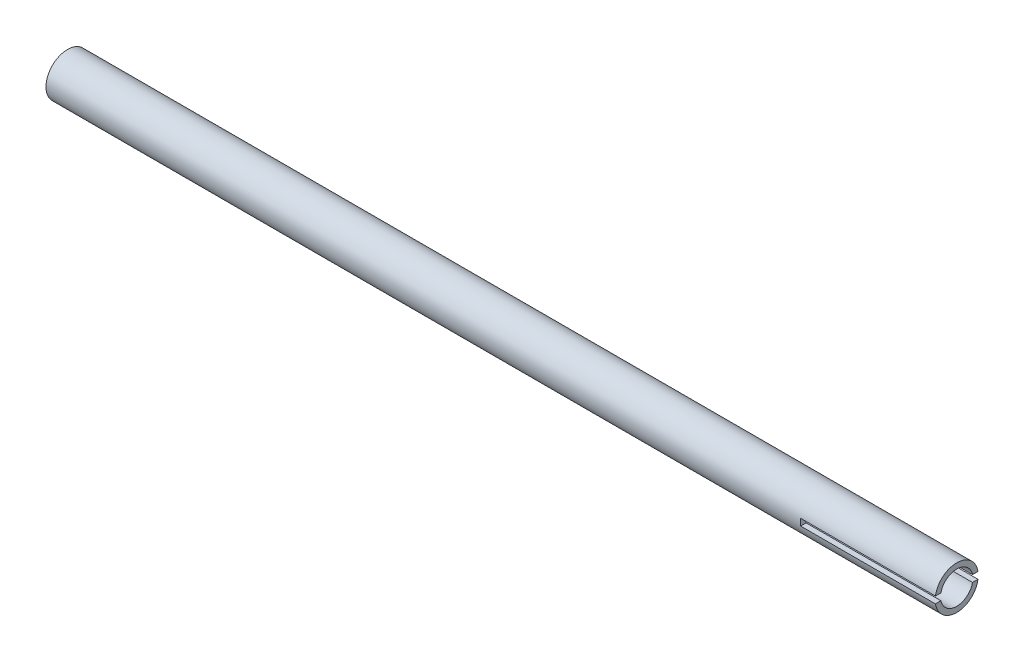
ISO-10303-21;
HEADER;
FILE_DESCRIPTION(('STEP AP214'),'2;1');
FILE_NAME('part.step','',(''),(''),'','','');
FILE_SCHEMA(('AUTOMOTIVE_DESIGN { 1 0 10303 214 1 1 1 1 }'));
ENDSEC;
DATA;
#1=APPLICATION_CONTEXT('core data for automotive mechanical design processes');
#2=APPLICATION_PROTOCOL_DEFINITION('international standard','automotive_design',2000,#1);
#3=PRODUCT_CONTEXT('',#1,'mechanical');
#4=PRODUCT('Part','Part','',(#3));
#5=PRODUCT_RELATED_PRODUCT_CATEGORY('part','',(#4));
#6=PRODUCT_DEFINITION_FORMATION('','',#4);
#7=PRODUCT_DEFINITION_CONTEXT('part definition',#1,'design');
#8=PRODUCT_DEFINITION('design','',#6,#7);
#9=PRODUCT_DEFINITION_SHAPE('','',#8);
#10=(LENGTH_UNIT() NAMED_UNIT(*) SI_UNIT(.MILLI.,.METRE.));
#11=(NAMED_UNIT(*) PLANE_ANGLE_UNIT() SI_UNIT($,.RADIAN.));
#12=(NAMED_UNIT(*) SI_UNIT($,.STERADIAN.) SOLID_ANGLE_UNIT());
#13=UNCERTAINTY_MEASURE_WITH_UNIT(LENGTH_MEASURE(1.E-05),#10,'distance_accuracy_value','');
#14=(GEOMETRIC_REPRESENTATION_CONTEXT(3) GLOBAL_UNCERTAINTY_ASSIGNED_CONTEXT((#13)) GLOBAL_UNIT_ASSIGNED_CONTEXT((#10,
#11,#12)) REPRESENTATION_CONTEXT('',''));
#15=CARTESIAN_POINT('',(0.,0.,0.));
#16=DIRECTION('',(0.,0.,1.));
#17=DIRECTION('',(1.,0.,0.));
#18=AXIS2_PLACEMENT_3D('',#15,#16,#17);
#19=CARTESIAN_POINT('',(165.,0.,0.));
#20=DIRECTION('',(1.,0.,0.));
#21=DIRECTION('',(0.,0.,-1.));
#22=AXIS2_PLACEMENT_3D('',#19,#20,#21);
#23=PLANE('',#22);
#24=DIRECTION('',(0.,0.,1.));
#25=VECTOR('',#24,1.);
#26=CARTESIAN_POINT('',(165.,-1.25,-8.));
#27=LINE('',#26,#25);
#28=CARTESIAN_POINT('',(165.,-1.25,5.86834729715275));
#29=VERTEX_POINT('',#28);
#30=CARTESIAN_POINT('',(165.,-1.25,7.90174031463955));
#31=VERTEX_POINT('',#30);
#32=EDGE_CURVE('E161',#29,#31,#27,.T.);
#33=ORIENTED_EDGE('',*,*,#32,.T.);
#34=CARTESIAN_POINT('',(165.,0.,0.));
#35=DIRECTION('',(1.,0.,0.));
#36=DIRECTION('',(0.,0.,-1.));
#37=AXIS2_PLACEMENT_3D('',#34,#35,#36);
#38=CIRCLE('',#37,8.);
#39=CARTESIAN_POINT('',(165.,-1.25,-7.90174031463955));
#40=VERTEX_POINT('',#39);
#41=EDGE_CURVE('E146',#31,#40,#38,.T.);
#42=ORIENTED_EDGE('',*,*,#41,.T.);
#43=CARTESIAN_POINT('',(165.,-1.25,-5.86834729715275));
#44=VERTEX_POINT('',#43);
#45=EDGE_CURVE('E130',#40,#44,#27,.T.);
#46=ORIENTED_EDGE('',*,*,#45,.T.);
#47=CARTESIAN_POINT('',(165.,0.,0.));
#48=DIRECTION('',(1.,0.,0.));
#49=DIRECTION('',(0.,0.,-1.));
#50=AXIS2_PLACEMENT_3D('',#47,#48,#49);
#51=CIRCLE('',#50,6.);
#52=EDGE_CURVE('E143',#29,#44,#51,.T.);
#53=ORIENTED_EDGE('',*,*,#52,.F.);
#54=EDGE_LOOP('',(#33,#42,#46,#53));
#55=FACE_BOUND('',#54,.T.);
#56=ADVANCED_FACE('F39',(#55),#23,.T.);
#57=DIRECTION('',(0.,0.,1.));
#58=VECTOR('',#57,1.);
#59=CARTESIAN_POINT('',(165.,1.25,-8.));
#60=LINE('',#59,#58);
#61=CARTESIAN_POINT('',(165.,1.25,-7.90174031463955));
#62=VERTEX_POINT('',#61);
#63=CARTESIAN_POINT('',(165.,1.25,-5.86834729715275));
#64=VERTEX_POINT('',#63);
#65=EDGE_CURVE('E62',#62,#64,#60,.T.);
#66=ORIENTED_EDGE('',*,*,#65,.F.);
#67=CARTESIAN_POINT('',(165.,1.25,7.90174031463955));
#68=VERTEX_POINT('',#67);
#69=EDGE_CURVE('E127',#62,#68,#38,.T.);
#70=ORIENTED_EDGE('',*,*,#69,.T.);
#71=CARTESIAN_POINT('',(165.,1.25,5.86834729715275));
#72=VERTEX_POINT('',#71);
#73=EDGE_CURVE('E174',#72,#68,#60,.T.);
#74=ORIENTED_EDGE('',*,*,#73,.F.);
#75=EDGE_CURVE('E139',#64,#72,#51,.T.);
#76=ORIENTED_EDGE('',*,*,#75,.F.);
#77=EDGE_LOOP('',(#66,#70,#74,#76));
#78=FACE_BOUND('',#77,.T.);
#79=ADVANCED_FACE('F180',(#78),#23,.T.);
#80=CARTESIAN_POINT('',(-165.,0.,0.));
#81=DIRECTION('',(1.,0.,0.));
#82=DIRECTION('',(0.,0.,-1.));
#83=AXIS2_PLACEMENT_3D('',#80,#81,#82);
#84=PLANE('',#83);
#85=CARTESIAN_POINT('',(-165.,0.,0.));
#86=DIRECTION('',(1.,0.,0.));
#87=DIRECTION('',(0.,0.,-1.));
#88=AXIS2_PLACEMENT_3D('',#85,#86,#87);
#89=CIRCLE('',#88,8.);
#90=CARTESIAN_POINT('',(-165.,0.,-8.));
#91=VERTEX_POINT('',#90);
#92=EDGE_CURVE('E142',#91,#91,#89,.T.);
#93=ORIENTED_EDGE('',*,*,#92,.F.);
#94=EDGE_LOOP('',(#93));
#95=FACE_BOUND('',#94,.T.);
#96=CARTESIAN_POINT('',(-165.,0.,0.));
#97=DIRECTION('',(1.,0.,0.));
#98=DIRECTION('',(0.,0.,-1.));
#99=AXIS2_PLACEMENT_3D('',#96,#97,#98);
#100=CIRCLE('',#99,6.);
#101=CARTESIAN_POINT('',(-165.,0.,-6.));
#102=VERTEX_POINT('',#101);
#103=EDGE_CURVE('E138',#102,#102,#100,.T.);
#104=ORIENTED_EDGE('',*,*,#103,.T.);
#105=EDGE_LOOP('',(#104));
#106=FACE_BOUND('',#105,.T.);
#107=ADVANCED_FACE('F199',(#95,#106),#84,.F.);
#108=CARTESIAN_POINT('',(165.,0.,0.));
#109=DIRECTION('',(-1.,0.,0.));
#110=DIRECTION('',(0.,0.,1.));
#111=AXIS2_PLACEMENT_3D('',#108,#109,#110);
#112=CYLINDRICAL_SURFACE('',#111,8.);
#113=DIRECTION('',(-1.,0.,0.));
#114=VECTOR('',#113,1.);
#115=CARTESIAN_POINT('',(165.,1.25,-7.90174031463955));
#116=LINE('',#115,#114);
#117=CARTESIAN_POINT('',(115.,1.24999999999999,-7.90174031463955));
#118=VERTEX_POINT('',#117);
#119=EDGE_CURVE('E119',#62,#118,#116,.T.);
#120=ORIENTED_EDGE('',*,*,#119,.T.);
#121=CARTESIAN_POINT('',(115.,0.,0.));
#122=DIRECTION('',(-1.,0.,0.));
#123=DIRECTION('',(0.,0.,1.));
#124=AXIS2_PLACEMENT_3D('',#121,#122,#123);
#125=CIRCLE('',#124,8.);
#126=CARTESIAN_POINT('',(115.,-1.25000000000001,-7.90174031463955));
#127=VERTEX_POINT('',#126);
#128=EDGE_CURVE('E104',#118,#127,#125,.T.);
#129=ORIENTED_EDGE('',*,*,#128,.T.);
#130=DIRECTION('',(-1.,0.,0.));
#131=VECTOR('',#130,1.);
#132=CARTESIAN_POINT('',(165.,-1.25,-7.90174031463955));
#133=LINE('',#132,#131);
#134=EDGE_CURVE('E115',#127,#40,#133,.F.);
#135=ORIENTED_EDGE('',*,*,#134,.T.);
#136=ORIENTED_EDGE('',*,*,#41,.F.);
#137=DIRECTION('',(-1.,0.,0.));
#138=VECTOR('',#137,1.);
#139=CARTESIAN_POINT('',(165.,-1.25,7.90174031463955));
#140=LINE('',#139,#138);
#141=CARTESIAN_POINT('',(115.,-1.25000000000001,7.90174031463955));
#142=VERTEX_POINT('',#141);
#143=EDGE_CURVE('E135',#31,#142,#140,.T.);
#144=ORIENTED_EDGE('',*,*,#143,.T.);
#145=CARTESIAN_POINT('',(115.,1.24999999999999,7.90174031463955));
#146=VERTEX_POINT('',#145);
#147=EDGE_CURVE('E116',#142,#146,#125,.T.);
#148=ORIENTED_EDGE('',*,*,#147,.T.);
#149=DIRECTION('',(-1.,0.,0.));
#150=VECTOR('',#149,1.);
#151=CARTESIAN_POINT('',(165.,1.25,7.90174031463955));
#152=LINE('',#151,#150);
#153=EDGE_CURVE('E128',#146,#68,#152,.F.);
#154=ORIENTED_EDGE('',*,*,#153,.T.);
#155=ORIENTED_EDGE('',*,*,#69,.F.);
#156=EDGE_LOOP('',(#120,#129,#135,#136,#144,#148,#154,#155));
#157=FACE_BOUND('',#156,.T.);
#158=ORIENTED_EDGE('',*,*,#92,.T.);
#159=EDGE_LOOP('',(#158));
#160=FACE_BOUND('',#159,.T.);
#161=ADVANCED_FACE('F41',(#157,#160),#112,.T.);
#162=CARTESIAN_POINT('',(165.,0.,0.));
#163=DIRECTION('',(-1.,0.,0.));
#164=DIRECTION('',(0.,0.,1.));
#165=AXIS2_PLACEMENT_3D('',#162,#163,#164);
#166=CYLINDRICAL_SURFACE('',#165,6.);
#167=DIRECTION('',(-1.,0.,0.));
#168=VECTOR('',#167,1.);
#169=CARTESIAN_POINT('',(165.,-1.25,-5.86834729715275));
#170=LINE('',#169,#168);
#171=CARTESIAN_POINT('',(115.,-1.25000000000001,-5.86834729715275));
#172=VERTEX_POINT('',#171);
#173=EDGE_CURVE('E11',#172,#44,#170,.F.);
#174=ORIENTED_EDGE('',*,*,#173,.F.);
#175=CARTESIAN_POINT('',(115.,0.,0.));
#176=DIRECTION('',(-1.,0.,0.));
#177=DIRECTION('',(0.,0.,1.));
#178=AXIS2_PLACEMENT_3D('',#175,#176,#177);
#179=CIRCLE('',#178,6.);
#180=CARTESIAN_POINT('',(115.,1.24999999999999,-5.86834729715275));
#181=VERTEX_POINT('',#180);
#182=EDGE_CURVE('E47',#181,#172,#179,.T.);
#183=ORIENTED_EDGE('',*,*,#182,.F.);
#184=DIRECTION('',(-1.,0.,0.));
#185=VECTOR('',#184,1.);
#186=CARTESIAN_POINT('',(165.,1.25,-5.86834729715275));
#187=LINE('',#186,#185);
#188=EDGE_CURVE('E120',#64,#181,#187,.T.);
#189=ORIENTED_EDGE('',*,*,#188,.F.);
#190=ORIENTED_EDGE('',*,*,#75,.T.);
#191=DIRECTION('',(-1.,0.,0.));
#192=VECTOR('',#191,1.);
#193=CARTESIAN_POINT('',(165.,1.25,5.86834729715275));
#194=LINE('',#193,#192);
#195=CARTESIAN_POINT('',(115.,1.25,5.86834729715275));
#196=VERTEX_POINT('',#195);
#197=EDGE_CURVE('E151',#196,#72,#194,.F.);
#198=ORIENTED_EDGE('',*,*,#197,.F.);
#199=CARTESIAN_POINT('',(115.,-1.25000000000001,5.86834729715275));
#200=VERTEX_POINT('',#199);
#201=EDGE_CURVE('E153',#200,#196,#179,.T.);
#202=ORIENTED_EDGE('',*,*,#201,.F.);
#203=DIRECTION('',(-1.,0.,0.));
#204=VECTOR('',#203,1.);
#205=CARTESIAN_POINT('',(165.,-1.25,5.86834729715275));
#206=LINE('',#205,#204);
#207=EDGE_CURVE('E155',#29,#200,#206,.T.);
#208=ORIENTED_EDGE('',*,*,#207,.F.);
#209=ORIENTED_EDGE('',*,*,#52,.T.);
#210=EDGE_LOOP('',(#174,#183,#189,#190,#198,#202,#208,#209));
#211=FACE_BOUND('',#210,.T.);
#212=ORIENTED_EDGE('',*,*,#103,.F.);
#213=EDGE_LOOP('',(#212));
#214=FACE_BOUND('',#213,.T.);
#215=ADVANCED_FACE('F164',(#211,#214),#166,.F.);
#216=CARTESIAN_POINT('',(165.,1.25,-8.));
#217=DIRECTION('',(0.,1.,0.));
#218=DIRECTION('',(-1.,0.,0.));
#219=AXIS2_PLACEMENT_3D('',#216,#217,#218);
#220=PLANE('',#219);
#221=DIRECTION('',(0.,0.,1.));
#222=VECTOR('',#221,1.);
#223=CARTESIAN_POINT('',(115.,1.24999999999999,-8.));
#224=LINE('',#223,#222);
#225=EDGE_CURVE('E54',#196,#146,#224,.T.);
#226=ORIENTED_EDGE('',*,*,#225,.F.);
#227=ORIENTED_EDGE('',*,*,#197,.T.);
#228=ORIENTED_EDGE('',*,*,#73,.T.);
#229=ORIENTED_EDGE('',*,*,#153,.F.);
#230=EDGE_LOOP('',(#226,#227,#228,#229));
#231=FACE_BOUND('',#230,.T.);
#232=ADVANCED_FACE('F176',(#231),#220,.F.);
#233=CARTESIAN_POINT('',(115.,1.24999999999999,-8.));
#234=DIRECTION('',(-1.,0.,0.));
#235=DIRECTION('',(0.,0.,1.));
#236=AXIS2_PLACEMENT_3D('',#233,#234,#235);
#237=PLANE('',#236);
#238=ORIENTED_EDGE('',*,*,#147,.F.);
#239=DIRECTION('',(0.,0.,1.));
#240=VECTOR('',#239,1.);
#241=CARTESIAN_POINT('',(115.,-1.25000000000001,-8.));
#242=LINE('',#241,#240);
#243=EDGE_CURVE('E121',#200,#142,#242,.T.);
#244=ORIENTED_EDGE('',*,*,#243,.F.);
#245=ORIENTED_EDGE('',*,*,#201,.T.);
#246=ORIENTED_EDGE('',*,*,#225,.T.);
#247=EDGE_LOOP('',(#238,#244,#245,#246));
#248=FACE_BOUND('',#247,.T.);
#249=ADVANCED_FACE('F183',(#248),#237,.F.);
#250=CARTESIAN_POINT('',(165.,-1.25,-8.));
#251=DIRECTION('',(0.,-1.,0.));
#252=DIRECTION('',(1.,0.,0.));
#253=AXIS2_PLACEMENT_3D('',#250,#251,#252);
#254=PLANE('',#253);
#255=ORIENTED_EDGE('',*,*,#32,.F.);
#256=ORIENTED_EDGE('',*,*,#207,.T.);
#257=ORIENTED_EDGE('',*,*,#243,.T.);
#258=ORIENTED_EDGE('',*,*,#143,.F.);
#259=EDGE_LOOP('',(#255,#256,#257,#258));
#260=FACE_BOUND('',#259,.T.);
#261=ADVANCED_FACE('F185',(#260),#254,.F.);
#262=EDGE_CURVE('E110',#127,#172,#242,.T.);
#263=ORIENTED_EDGE('',*,*,#262,.T.);
#264=ORIENTED_EDGE('',*,*,#173,.T.);
#265=ORIENTED_EDGE('',*,*,#45,.F.);
#266=ORIENTED_EDGE('',*,*,#134,.F.);
#267=EDGE_LOOP('',(#263,#264,#265,#266));
#268=FACE_BOUND('',#267,.T.);
#269=ADVANCED_FACE('F159',(#268),#254,.F.);
#270=EDGE_CURVE('E107',#118,#181,#224,.T.);
#271=ORIENTED_EDGE('',*,*,#270,.T.);
#272=ORIENTED_EDGE('',*,*,#182,.T.);
#273=ORIENTED_EDGE('',*,*,#262,.F.);
#274=ORIENTED_EDGE('',*,*,#128,.F.);
#275=EDGE_LOOP('',(#271,#272,#273,#274));
#276=FACE_BOUND('',#275,.T.);
#277=ADVANCED_FACE('F106',(#276),#237,.F.);
#278=ORIENTED_EDGE('',*,*,#65,.T.);
#279=ORIENTED_EDGE('',*,*,#188,.T.);
#280=ORIENTED_EDGE('',*,*,#270,.F.);
#281=ORIENTED_EDGE('',*,*,#119,.F.);
#282=EDGE_LOOP('',(#278,#279,#280,#281));
#283=FACE_BOUND('',#282,.T.);
#284=ADVANCED_FACE('F118',(#283),#220,.F.);
#285=CLOSED_SHELL('',(#56,#79,#107,#161,#215,#232,#249,#261,#269,#277,#284));
#286=MANIFOLD_SOLID_BREP('B2',#285);
#287=ADVANCED_BREP_SHAPE_REPRESENTATION('',(#18,#286),#14);
#288=SHAPE_DEFINITION_REPRESENTATION(#9,#287);
ENDSEC;
END-ISO-10303-21;
